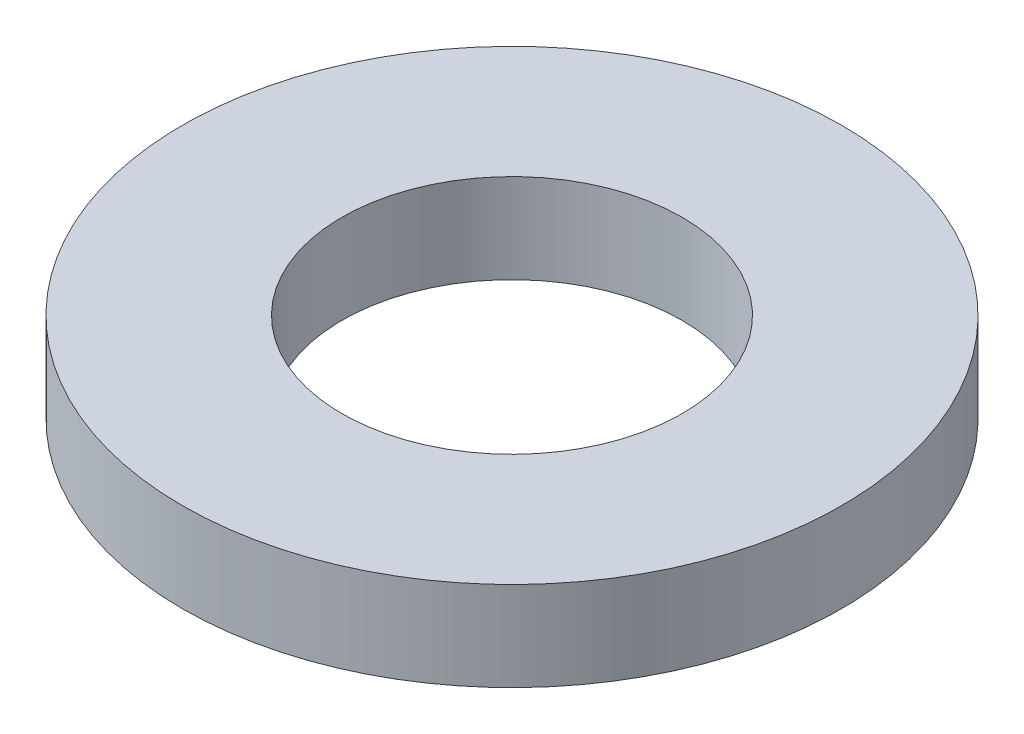
ISO-10303-21;
HEADER;
FILE_DESCRIPTION(('STEP AP214'),'2;1');
FILE_NAME('part.step','',(''),(''),'','','');
FILE_SCHEMA(('AUTOMOTIVE_DESIGN { 1 0 10303 214 1 1 1 1 }'));
ENDSEC;
DATA;
#1=APPLICATION_CONTEXT('core data for automotive mechanical design processes');
#2=APPLICATION_PROTOCOL_DEFINITION('international standard','automotive_design',2000,#1);
#3=PRODUCT_CONTEXT('',#1,'mechanical');
#4=PRODUCT('Part','Part','',(#3));
#5=PRODUCT_RELATED_PRODUCT_CATEGORY('part','',(#4));
#6=PRODUCT_DEFINITION_FORMATION('','',#4);
#7=PRODUCT_DEFINITION_CONTEXT('part definition',#1,'design');
#8=PRODUCT_DEFINITION('design','',#6,#7);
#9=PRODUCT_DEFINITION_SHAPE('','',#8);
#10=(LENGTH_UNIT() NAMED_UNIT(*) SI_UNIT(.MILLI.,.METRE.));
#11=(NAMED_UNIT(*) PLANE_ANGLE_UNIT() SI_UNIT($,.RADIAN.));
#12=(NAMED_UNIT(*) SI_UNIT($,.STERADIAN.) SOLID_ANGLE_UNIT());
#13=UNCERTAINTY_MEASURE_WITH_UNIT(LENGTH_MEASURE(1.E-05),#10,'distance_accuracy_value','');
#14=(GEOMETRIC_REPRESENTATION_CONTEXT(3) GLOBAL_UNCERTAINTY_ASSIGNED_CONTEXT((#13)) GLOBAL_UNIT_ASSIGNED_CONTEXT((#10,
#11,#12)) REPRESENTATION_CONTEXT('',''));
#15=CARTESIAN_POINT('',(0.,0.,0.));
#16=DIRECTION('',(0.,0.,1.));
#17=DIRECTION('',(1.,0.,0.));
#18=AXIS2_PLACEMENT_3D('',#15,#16,#17);
#19=CARTESIAN_POINT('',(0.,21.,0.));
#20=DIRECTION('',(0.,-1.,0.));
#21=DIRECTION('',(0.,0.,-1.));
#22=AXIS2_PLACEMENT_3D('',#19,#20,#21);
#23=CYLINDRICAL_SURFACE('',#22,77.5);
#24=CARTESIAN_POINT('',(0.,21.,0.));
#25=DIRECTION('',(0.,1.,0.));
#26=DIRECTION('',(0.,0.,1.));
#27=AXIS2_PLACEMENT_3D('',#24,#25,#26);
#28=CIRCLE('',#27,77.5);
#29=CARTESIAN_POINT('',(0.,21.,-77.5));
#30=VERTEX_POINT('',#29);
#31=EDGE_CURVE('E10',#30,#30,#28,.T.);
#32=CARTESIAN_POINT('',(0.,0.,0.));
#33=DIRECTION('',(0.,1.,0.));
#34=DIRECTION('',(0.,0.,1.));
#35=AXIS2_PLACEMENT_3D('',#32,#33,#34);
#36=CIRCLE('',#35,77.5);
#37=CARTESIAN_POINT('',(0.,0.,-77.5));
#38=VERTEX_POINT('',#37);
#39=EDGE_CURVE('E37',#38,#38,#36,.T.);
#40=CARTESIAN_POINT('',(0.,21.,-77.5));
#41=CARTESIAN_POINT('',(0.,20.78125,-77.5));
#42=CARTESIAN_POINT('',(0.,20.5625,-77.5));
#43=CARTESIAN_POINT('',(0.,20.125,-77.5));
#44=CARTESIAN_POINT('',(0.,19.90625,-77.5));
#45=CARTESIAN_POINT('',(0.,19.46875,-77.5));
#46=CARTESIAN_POINT('',(0.,19.25,-77.5));
#47=CARTESIAN_POINT('',(0.,18.8125,-77.5));
#48=CARTESIAN_POINT('',(0.,18.59375,-77.5));
#49=CARTESIAN_POINT('',(0.,18.15625,-77.5));
#50=CARTESIAN_POINT('',(0.,17.9375,-77.5));
#51=CARTESIAN_POINT('',(0.,17.5,-77.5));
#52=CARTESIAN_POINT('',(0.,17.28125,-77.5));
#53=CARTESIAN_POINT('',(0.,16.84375,-77.5));
#54=CARTESIAN_POINT('',(0.,16.625,-77.5));
#55=CARTESIAN_POINT('',(0.,16.1875,-77.5));
#56=CARTESIAN_POINT('',(0.,15.96875,-77.5));
#57=CARTESIAN_POINT('',(0.,15.53125,-77.5));
#58=CARTESIAN_POINT('',(0.,15.3125,-77.5));
#59=CARTESIAN_POINT('',(0.,14.875,-77.5));
#60=CARTESIAN_POINT('',(0.,14.65625,-77.5));
#61=CARTESIAN_POINT('',(0.,14.21875,-77.5));
#62=CARTESIAN_POINT('',(0.,14.,-77.5));
#63=CARTESIAN_POINT('',(0.,13.5625,-77.5));
#64=CARTESIAN_POINT('',(0.,13.34375,-77.5));
#65=CARTESIAN_POINT('',(0.,12.90625,-77.5));
#66=CARTESIAN_POINT('',(0.,12.6875,-77.5));
#67=CARTESIAN_POINT('',(0.,12.25,-77.5));
#68=CARTESIAN_POINT('',(0.,12.03125,-77.5));
#69=CARTESIAN_POINT('',(0.,11.59375,-77.5));
#70=CARTESIAN_POINT('',(0.,11.375,-77.5));
#71=CARTESIAN_POINT('',(0.,10.9375,-77.5));
#72=CARTESIAN_POINT('',(0.,10.71875,-77.5));
#73=CARTESIAN_POINT('',(0.,10.28125,-77.5));
#74=CARTESIAN_POINT('',(0.,10.0625,-77.5));
#75=CARTESIAN_POINT('',(0.,9.625,-77.5));
#76=CARTESIAN_POINT('',(0.,9.40625,-77.5));
#77=CARTESIAN_POINT('',(0.,8.96875,-77.5));
#78=CARTESIAN_POINT('',(0.,8.75,-77.5));
#79=CARTESIAN_POINT('',(0.,8.3125,-77.5));
#80=CARTESIAN_POINT('',(0.,8.09375,-77.5));
#81=CARTESIAN_POINT('',(0.,7.65625,-77.5));
#82=CARTESIAN_POINT('',(0.,7.4375,-77.5));
#83=CARTESIAN_POINT('',(0.,7.,-77.5));
#84=CARTESIAN_POINT('',(0.,6.78125,-77.5));
#85=CARTESIAN_POINT('',(0.,6.34375,-77.5));
#86=CARTESIAN_POINT('',(0.,6.125,-77.5));
#87=CARTESIAN_POINT('',(0.,5.6875,-77.5));
#88=CARTESIAN_POINT('',(0.,5.46875,-77.5));
#89=CARTESIAN_POINT('',(0.,5.03125,-77.5));
#90=CARTESIAN_POINT('',(0.,4.8125,-77.5));
#91=CARTESIAN_POINT('',(0.,4.375,-77.5));
#92=CARTESIAN_POINT('',(0.,4.15625,-77.5));
#93=CARTESIAN_POINT('',(0.,3.71875,-77.5));
#94=CARTESIAN_POINT('',(0.,3.5,-77.5));
#95=CARTESIAN_POINT('',(0.,3.0625,-77.5));
#96=CARTESIAN_POINT('',(0.,2.84375,-77.5));
#97=CARTESIAN_POINT('',(0.,2.40625,-77.5));
#98=CARTESIAN_POINT('',(0.,2.1875,-77.5));
#99=CARTESIAN_POINT('',(0.,1.75,-77.5));
#100=CARTESIAN_POINT('',(0.,1.53125,-77.5));
#101=CARTESIAN_POINT('',(0.,1.09375,-77.5));
#102=CARTESIAN_POINT('',(0.,0.875000000000001,-77.5));
#103=CARTESIAN_POINT('',(0.,0.4375,-77.5));
#104=CARTESIAN_POINT('',(0.,0.21875,-77.5));
#105=CARTESIAN_POINT('',(0.,0.,-77.5));
#106=B_SPLINE_CURVE_WITH_KNOTS('',3,(#40,#41,#42,#43,#44,#45,#46,#47,#48,#49,#50,#51,#52,#53,
#54,#55,#56,#57,#58,#59,#60,#61,#62,#63,#64,#65,#66,#67,#68,#69,#70,#71,#72,#73,#74,#75,#76,#77,
#78,#79,#80,#81,#82,#83,#84,#85,#86,#87,#88,#89,#90,#91,#92,#93,#94,#95,#96,#97,#98,#99,#100,
#101,#102,#103,#104,#105),.UNSPECIFIED.,.F.,.F.,(4,2,2,2,2,2,2,2,2,2,2,2,2,2,2,2,2,2,2,2,2,2,2,
2,2,2,2,2,2,2,2,2,4),(0.,0.656249999999997,1.3125,1.96875,2.625,3.28125,3.9375,4.59375,5.25,
5.90625,6.5625,7.21875,7.875,8.53125,9.1875,9.84375,10.5,11.15625,11.8125,12.46875,13.125,
13.78125,14.4375,15.09375,15.75,16.40625,17.0625,17.71875,18.375,19.03125,19.6875,20.34375,21.),.UNSPECIFIED.);
#107=EDGE_CURVE('BSEAM40',#30,#38,#106,.T.);
#108=ORIENTED_EDGE('',*,*,#31,.F.);
#109=ORIENTED_EDGE('',*,*,#39,.T.);
#110=ORIENTED_EDGE('',*,*,#107,.T.);
#111=ORIENTED_EDGE('',*,*,#107,.F.);
#112=EDGE_LOOP('',(#108,#110,#109,#111));
#113=FACE_BOUND('',#112,.T.);
#114=ADVANCED_FACE('F40',(#113),#23,.T.);
#115=CARTESIAN_POINT('',(0.,21.,0.));
#116=DIRECTION('',(0.,1.,0.));
#117=DIRECTION('',(0.,0.,1.));
#118=AXIS2_PLACEMENT_3D('',#115,#116,#117);
#119=PLANE('',#118);
#120=CARTESIAN_POINT('',(0.,21.,0.));
#121=DIRECTION('',(0.,1.,0.));
#122=DIRECTION('',(0.,0.,1.));
#123=AXIS2_PLACEMENT_3D('',#120,#121,#122);
#124=CIRCLE('',#123,40.);
#125=CARTESIAN_POINT('',(0.,21.,-40.));
#126=VERTEX_POINT('',#125);
#127=EDGE_CURVE('E50',#126,#126,#124,.T.);
#128=ORIENTED_EDGE('',*,*,#127,.F.);
#129=EDGE_LOOP('',(#128));
#130=FACE_BOUND('',#129,.T.);
#131=ORIENTED_EDGE('',*,*,#31,.T.);
#132=EDGE_LOOP('',(#131));
#133=FACE_BOUND('',#132,.T.);
#134=ADVANCED_FACE('F59',(#130,#133),#119,.T.);
#135=CARTESIAN_POINT('',(0.,0.,0.));
#136=DIRECTION('',(0.,1.,0.));
#137=DIRECTION('',(0.,0.,1.));
#138=AXIS2_PLACEMENT_3D('',#135,#136,#137);
#139=PLANE('',#138);
#140=CARTESIAN_POINT('',(0.,0.,0.));
#141=DIRECTION('',(0.,1.,0.));
#142=DIRECTION('',(0.,0.,1.));
#143=AXIS2_PLACEMENT_3D('',#140,#141,#142);
#144=CIRCLE('',#143,40.);
#145=CARTESIAN_POINT('',(0.,0.,-40.));
#146=VERTEX_POINT('',#145);
#147=EDGE_CURVE('E47',#146,#146,#144,.T.);
#148=ORIENTED_EDGE('',*,*,#147,.T.);
#149=EDGE_LOOP('',(#148));
#150=FACE_BOUND('',#149,.T.);
#151=ORIENTED_EDGE('',*,*,#39,.F.);
#152=EDGE_LOOP('',(#151));
#153=FACE_BOUND('',#152,.T.);
#154=ADVANCED_FACE('F58',(#150,#153),#139,.F.);
#155=CARTESIAN_POINT('',(0.,21.,0.));
#156=DIRECTION('',(0.,-1.,0.));
#157=DIRECTION('',(0.,0.,-1.));
#158=AXIS2_PLACEMENT_3D('',#155,#156,#157);
#159=CYLINDRICAL_SURFACE('',#158,40.);
#160=CARTESIAN_POINT('',(0.,21.,-40.));
#161=CARTESIAN_POINT('',(0.,20.78125,-40.));
#162=CARTESIAN_POINT('',(0.,20.5625,-40.));
#163=CARTESIAN_POINT('',(0.,20.125,-40.));
#164=CARTESIAN_POINT('',(0.,19.90625,-40.));
#165=CARTESIAN_POINT('',(0.,19.46875,-40.));
#166=CARTESIAN_POINT('',(0.,19.25,-40.));
#167=CARTESIAN_POINT('',(0.,18.8125,-40.));
#168=CARTESIAN_POINT('',(0.,18.59375,-40.));
#169=CARTESIAN_POINT('',(0.,18.15625,-40.));
#170=CARTESIAN_POINT('',(0.,17.9375,-40.));
#171=CARTESIAN_POINT('',(0.,17.5,-40.));
#172=CARTESIAN_POINT('',(0.,17.28125,-40.));
#173=CARTESIAN_POINT('',(0.,16.84375,-40.));
#174=CARTESIAN_POINT('',(0.,16.625,-40.));
#175=CARTESIAN_POINT('',(0.,16.1875,-40.));
#176=CARTESIAN_POINT('',(0.,15.96875,-40.));
#177=CARTESIAN_POINT('',(0.,15.53125,-40.));
#178=CARTESIAN_POINT('',(0.,15.3125,-40.));
#179=CARTESIAN_POINT('',(0.,14.875,-40.));
#180=CARTESIAN_POINT('',(0.,14.65625,-40.));
#181=CARTESIAN_POINT('',(0.,14.21875,-40.));
#182=CARTESIAN_POINT('',(0.,14.,-40.));
#183=CARTESIAN_POINT('',(0.,13.5625,-40.));
#184=CARTESIAN_POINT('',(0.,13.34375,-40.));
#185=CARTESIAN_POINT('',(0.,12.90625,-40.));
#186=CARTESIAN_POINT('',(0.,12.6875,-40.));
#187=CARTESIAN_POINT('',(0.,12.25,-40.));
#188=CARTESIAN_POINT('',(0.,12.03125,-40.));
#189=CARTESIAN_POINT('',(0.,11.59375,-40.));
#190=CARTESIAN_POINT('',(0.,11.375,-40.));
#191=CARTESIAN_POINT('',(0.,10.9375,-40.));
#192=CARTESIAN_POINT('',(0.,10.71875,-40.));
#193=CARTESIAN_POINT('',(0.,10.28125,-40.));
#194=CARTESIAN_POINT('',(0.,10.0625,-40.));
#195=CARTESIAN_POINT('',(0.,9.625,-40.));
#196=CARTESIAN_POINT('',(0.,9.40625,-40.));
#197=CARTESIAN_POINT('',(0.,8.96875,-40.));
#198=CARTESIAN_POINT('',(0.,8.75,-40.));
#199=CARTESIAN_POINT('',(0.,8.3125,-40.));
#200=CARTESIAN_POINT('',(0.,8.09375,-40.));
#201=CARTESIAN_POINT('',(0.,7.65625,-40.));
#202=CARTESIAN_POINT('',(0.,7.4375,-40.));
#203=CARTESIAN_POINT('',(0.,7.,-40.));
#204=CARTESIAN_POINT('',(0.,6.78125,-40.));
#205=CARTESIAN_POINT('',(0.,6.34375,-40.));
#206=CARTESIAN_POINT('',(0.,6.125,-40.));
#207=CARTESIAN_POINT('',(0.,5.6875,-40.));
#208=CARTESIAN_POINT('',(0.,5.46875,-40.));
#209=CARTESIAN_POINT('',(0.,5.03125,-40.));
#210=CARTESIAN_POINT('',(0.,4.8125,-40.));
#211=CARTESIAN_POINT('',(0.,4.375,-40.));
#212=CARTESIAN_POINT('',(0.,4.15625,-40.));
#213=CARTESIAN_POINT('',(0.,3.71875,-40.));
#214=CARTESIAN_POINT('',(0.,3.5,-40.));
#215=CARTESIAN_POINT('',(0.,3.0625,-40.));
#216=CARTESIAN_POINT('',(0.,2.84375,-40.));
#217=CARTESIAN_POINT('',(0.,2.40625,-40.));
#218=CARTESIAN_POINT('',(0.,2.1875,-40.));
#219=CARTESIAN_POINT('',(0.,1.75,-40.));
#220=CARTESIAN_POINT('',(0.,1.53125,-40.));
#221=CARTESIAN_POINT('',(0.,1.09375,-40.));
#222=CARTESIAN_POINT('',(0.,0.875000000000001,-40.));
#223=CARTESIAN_POINT('',(0.,0.4375,-40.));
#224=CARTESIAN_POINT('',(0.,0.21875,-40.));
#225=CARTESIAN_POINT('',(0.,0.,-40.));
#226=B_SPLINE_CURVE_WITH_KNOTS('',3,(#160,#161,#162,#163,#164,#165,#166,#167,#168,#169,#170,
#171,#172,#173,#174,#175,#176,#177,#178,#179,#180,#181,#182,#183,#184,#185,#186,#187,#188,#189,
#190,#191,#192,#193,#194,#195,#196,#197,#198,#199,#200,#201,#202,#203,#204,#205,#206,#207,#208,
#209,#210,#211,#212,#213,#214,#215,#216,#217,#218,#219,#220,#221,#222,#223,#224,#225),
.UNSPECIFIED.,.F.,.F.,(4,2,2,2,2,2,2,2,2,2,2,2,2,2,2,2,2,2,2,2,2,2,2,2,2,2,2,2,2,2,2,2,4),(0.,
0.656249999999997,1.3125,1.96875,2.625,3.28125,3.9375,4.59375,5.25,5.90625,6.5625,7.21875,7.875,
8.53125,9.1875,9.84375,10.5,11.15625,11.8125,12.46875,13.125,13.78125,14.4375,15.09375,15.75,
16.40625,17.0625,17.71875,18.375,19.03125,19.6875,20.34375,21.),.UNSPECIFIED.);
#227=EDGE_CURVE('BSEAM54',#126,#146,#226,.T.);
#228=ORIENTED_EDGE('',*,*,#127,.T.);
#229=ORIENTED_EDGE('',*,*,#147,.F.);
#230=ORIENTED_EDGE('',*,*,#227,.T.);
#231=ORIENTED_EDGE('',*,*,#227,.F.);
#232=EDGE_LOOP('',(#228,#230,#229,#231));
#233=FACE_BOUND('',#232,.T.);
#234=ADVANCED_FACE('F54',(#233),#159,.F.);
#235=CLOSED_SHELL('',(#114,#134,#154,#234));
#236=MANIFOLD_SOLID_BREP('B2',#235);
#237=ADVANCED_BREP_SHAPE_REPRESENTATION('',(#18,#236),#14);
#238=SHAPE_DEFINITION_REPRESENTATION(#9,#237);
ENDSEC;
END-ISO-10303-21;
